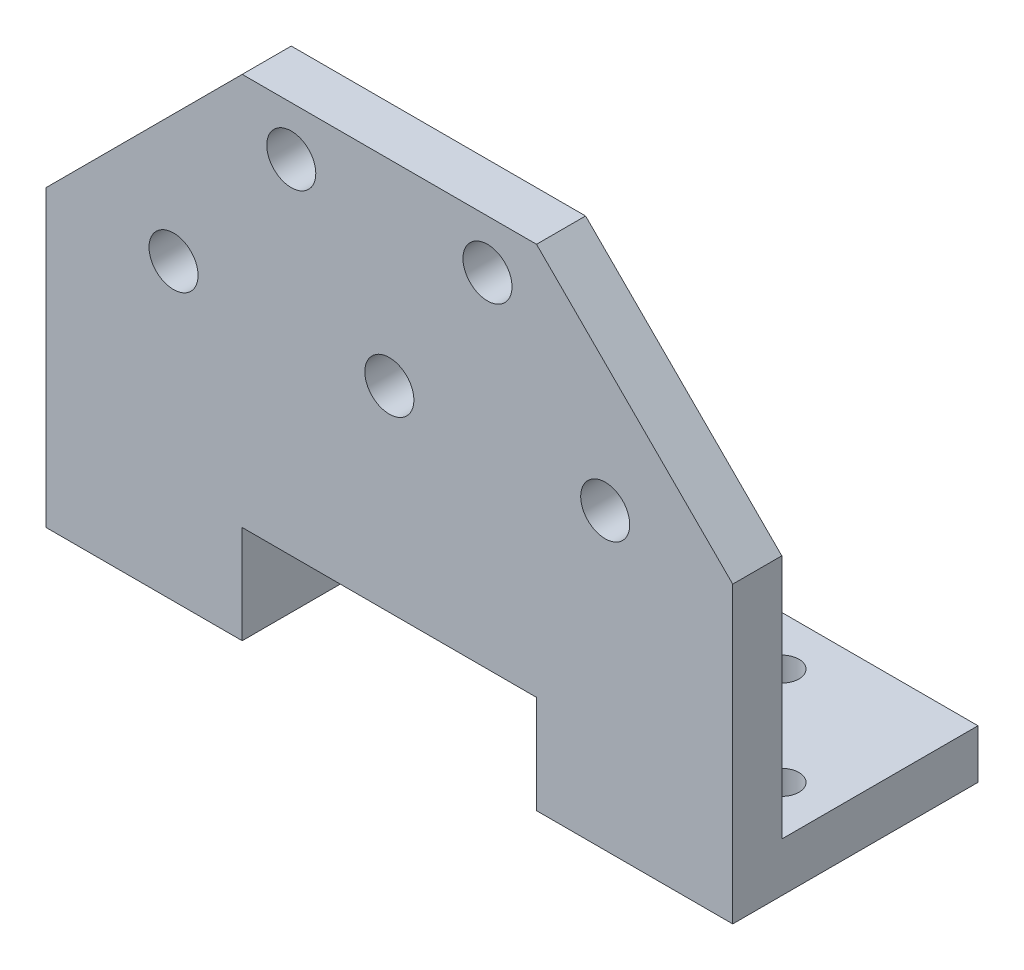
ISO-10303-21;
HEADER;
FILE_DESCRIPTION(('STEP AP214'),'2;1');
FILE_NAME('part.step','',(''),(''),'','','');
FILE_SCHEMA(('AUTOMOTIVE_DESIGN { 1 0 10303 214 1 1 1 1 }'));
ENDSEC;
DATA;
#1=APPLICATION_CONTEXT('core data for automotive mechanical design processes');
#2=APPLICATION_PROTOCOL_DEFINITION('international standard','automotive_design',2000,#1);
#3=PRODUCT_CONTEXT('',#1,'mechanical');
#4=PRODUCT('Part','Part','',(#3));
#5=PRODUCT_RELATED_PRODUCT_CATEGORY('part','',(#4));
#6=PRODUCT_DEFINITION_FORMATION('','',#4);
#7=PRODUCT_DEFINITION_CONTEXT('part definition',#1,'design');
#8=PRODUCT_DEFINITION('design','',#6,#7);
#9=PRODUCT_DEFINITION_SHAPE('','',#8);
#10=(LENGTH_UNIT() NAMED_UNIT(*) SI_UNIT(.MILLI.,.METRE.));
#11=(NAMED_UNIT(*) PLANE_ANGLE_UNIT() SI_UNIT($,.RADIAN.));
#12=(NAMED_UNIT(*) SI_UNIT($,.STERADIAN.) SOLID_ANGLE_UNIT());
#13=UNCERTAINTY_MEASURE_WITH_UNIT(LENGTH_MEASURE(1.E-05),#10,'distance_accuracy_value','');
#14=(GEOMETRIC_REPRESENTATION_CONTEXT(3) GLOBAL_UNCERTAINTY_ASSIGNED_CONTEXT((#13)) GLOBAL_UNIT_ASSIGNED_CONTEXT((#10,
#11,#12)) REPRESENTATION_CONTEXT('',''));
#15=CARTESIAN_POINT('',(0.,0.,0.));
#16=DIRECTION('',(0.,0.,1.));
#17=DIRECTION('',(1.,0.,0.));
#18=AXIS2_PLACEMENT_3D('',#15,#16,#17);
#19=CARTESIAN_POINT('',(0.,0.,0.));
#20=DIRECTION('',(0.,0.,1.));
#21=DIRECTION('',(1.,0.,0.));
#22=AXIS2_PLACEMENT_3D('',#19,#20,#21);
#23=PLANE('',#22);
#24=CARTESIAN_POINT('',(22.,30.,0.));
#25=DIRECTION('',(0.,0.,-1.));
#26=DIRECTION('',(-1.,0.,0.));
#27=AXIS2_PLACEMENT_3D('',#24,#25,#26);
#28=CIRCLE('',#27,2.5);
#29=CARTESIAN_POINT('',(19.5,30.,0.));
#30=VERTEX_POINT('',#29);
#31=EDGE_CURVE('E397',#30,#30,#28,.T.);
#32=ORIENTED_EDGE('',*,*,#31,.F.);
#33=EDGE_LOOP('',(#32));
#34=FACE_BOUND('',#33,.T.);
#35=CARTESIAN_POINT('',(0.,30.,0.));
#36=DIRECTION('',(0.,0.,-1.));
#37=DIRECTION('',(-1.,0.,0.));
#38=AXIS2_PLACEMENT_3D('',#35,#36,#37);
#39=CIRCLE('',#38,2.5);
#40=CARTESIAN_POINT('',(-2.5,30.,0.));
#41=VERTEX_POINT('',#40);
#42=EDGE_CURVE('E402',#41,#41,#39,.T.);
#43=ORIENTED_EDGE('',*,*,#42,.F.);
#44=EDGE_LOOP('',(#43));
#45=FACE_BOUND('',#44,.T.);
#46=CARTESIAN_POINT('',(10.,45.,0.));
#47=DIRECTION('',(0.,0.,-1.));
#48=DIRECTION('',(-1.,0.,0.));
#49=AXIS2_PLACEMENT_3D('',#46,#47,#48);
#50=CIRCLE('',#49,2.5);
#51=CARTESIAN_POINT('',(7.5,45.,0.));
#52=VERTEX_POINT('',#51);
#53=EDGE_CURVE('E410',#52,#52,#50,.T.);
#54=ORIENTED_EDGE('',*,*,#53,.F.);
#55=EDGE_LOOP('',(#54));
#56=FACE_BOUND('',#55,.T.);
#57=CARTESIAN_POINT('',(-10.,45.,0.));
#58=DIRECTION('',(0.,0.,-1.));
#59=DIRECTION('',(1.,0.,0.));
#60=AXIS2_PLACEMENT_3D('',#57,#58,#59);
#61=CIRCLE('',#60,2.5);
#62=CARTESIAN_POINT('',(-7.5,45.,0.));
#63=VERTEX_POINT('',#62);
#64=EDGE_CURVE('E416',#63,#63,#61,.T.);
#65=ORIENTED_EDGE('',*,*,#64,.F.);
#66=EDGE_LOOP('',(#65));
#67=FACE_BOUND('',#66,.T.);
#68=CARTESIAN_POINT('',(-22.,30.,0.));
#69=DIRECTION('',(0.,0.,-1.));
#70=DIRECTION('',(1.,0.,0.));
#71=AXIS2_PLACEMENT_3D('',#68,#69,#70);
#72=CIRCLE('',#71,2.5);
#73=CARTESIAN_POINT('',(-19.5,30.,0.));
#74=VERTEX_POINT('',#73);
#75=EDGE_CURVE('E421',#74,#74,#72,.T.);
#76=ORIENTED_EDGE('',*,*,#75,.F.);
#77=EDGE_LOOP('',(#76));
#78=FACE_BOUND('',#77,.T.);
#79=DIRECTION('',(-0.707106781186549,0.707106781186546,0.));
#80=VECTOR('',#79,1.);
#81=CARTESIAN_POINT('',(32.4999999999999,32.5000000000001,0.));
#82=LINE('',#81,#80);
#83=CARTESIAN_POINT('',(35.,30.,0.));
#84=VERTEX_POINT('',#83);
#85=CARTESIAN_POINT('',(14.9999999999999,50.,0.));
#86=VERTEX_POINT('',#85);
#87=EDGE_CURVE('E139',#84,#86,#82,.T.);
#88=ORIENTED_EDGE('',*,*,#87,.F.);
#89=DIRECTION('',(0.,1.,0.));
#90=VECTOR('',#89,1.);
#91=CARTESIAN_POINT('',(35.,0.,0.));
#92=LINE('',#91,#90);
#93=CARTESIAN_POINT('',(35.,5.,0.));
#94=VERTEX_POINT('',#93);
#95=EDGE_CURVE('E161',#94,#84,#92,.T.);
#96=ORIENTED_EDGE('',*,*,#95,.F.);
#97=DIRECTION('',(1.,0.,0.));
#98=VECTOR('',#97,1.);
#99=CARTESIAN_POINT('',(35.,5.,0.));
#100=LINE('',#99,#98);
#101=CARTESIAN_POINT('',(15.,5.,0.));
#102=VERTEX_POINT('',#101);
#103=EDGE_CURVE('E227',#102,#94,#100,.T.);
#104=ORIENTED_EDGE('',*,*,#103,.F.);
#105=DIRECTION('',(0.,-1.,0.));
#106=VECTOR('',#105,1.);
#107=CARTESIAN_POINT('',(15.,10.,0.));
#108=LINE('',#107,#106);
#109=CARTESIAN_POINT('',(15.,10.,0.));
#110=VERTEX_POINT('',#109);
#111=EDGE_CURVE('E254',#110,#102,#108,.T.);
#112=ORIENTED_EDGE('',*,*,#111,.F.);
#113=DIRECTION('',(1.,0.,0.));
#114=VECTOR('',#113,1.);
#115=CARTESIAN_POINT('',(-15.,10.,0.));
#116=LINE('',#115,#114);
#117=CARTESIAN_POINT('',(-15.,10.,0.));
#118=VERTEX_POINT('',#117);
#119=EDGE_CURVE('E159',#118,#110,#116,.T.);
#120=ORIENTED_EDGE('',*,*,#119,.F.);
#121=DIRECTION('',(0.,1.,0.));
#122=VECTOR('',#121,1.);
#123=CARTESIAN_POINT('',(-15.,10.,0.));
#124=LINE('',#123,#122);
#125=CARTESIAN_POINT('',(-15.,5.,0.));
#126=VERTEX_POINT('',#125);
#127=EDGE_CURVE('E156',#126,#118,#124,.T.);
#128=ORIENTED_EDGE('',*,*,#127,.F.);
#129=DIRECTION('',(1.,0.,0.));
#130=VECTOR('',#129,1.);
#131=CARTESIAN_POINT('',(-35.,5.,0.));
#132=LINE('',#131,#130);
#133=CARTESIAN_POINT('',(-35.,5.,0.));
#134=VERTEX_POINT('',#133);
#135=EDGE_CURVE('E154',#134,#126,#132,.T.);
#136=ORIENTED_EDGE('',*,*,#135,.F.);
#137=DIRECTION('',(0.,-1.,0.));
#138=VECTOR('',#137,1.);
#139=CARTESIAN_POINT('',(-35.,0.,0.));
#140=LINE('',#139,#138);
#141=CARTESIAN_POINT('',(-35.,30.,0.));
#142=VERTEX_POINT('',#141);
#143=EDGE_CURVE('E146',#142,#134,#140,.T.);
#144=ORIENTED_EDGE('',*,*,#143,.F.);
#145=DIRECTION('',(-0.707106781186549,-0.707106781186546,0.));
#146=VECTOR('',#145,1.);
#147=CARTESIAN_POINT('',(-32.4999999999999,32.5000000000001,0.));
#148=LINE('',#147,#146);
#149=CARTESIAN_POINT('',(-14.9999999999999,50.,0.));
#150=VERTEX_POINT('',#149);
#151=EDGE_CURVE('E131',#150,#142,#148,.T.);
#152=ORIENTED_EDGE('',*,*,#151,.F.);
#153=DIRECTION('',(-1.,0.,0.));
#154=VECTOR('',#153,1.);
#155=CARTESIAN_POINT('',(35.,50.,0.));
#156=LINE('',#155,#154);
#157=EDGE_CURVE('E157',#86,#150,#156,.T.);
#158=ORIENTED_EDGE('',*,*,#157,.F.);
#159=EDGE_LOOP('',(#88,#96,#104,#112,#120,#128,#136,#144,#152,#158));
#160=FACE_BOUND('',#159,.T.);
#161=ADVANCED_FACE('F33',(#34,#45,#56,#67,#78,#160),#23,.F.);
#162=CARTESIAN_POINT('',(35.,0.,5.));
#163=DIRECTION('',(-1.,0.,0.));
#164=DIRECTION('',(0.,0.,1.));
#165=AXIS2_PLACEMENT_3D('',#162,#163,#164);
#166=PLANE('',#165);
#167=DIRECTION('',(0.,0.,-1.));
#168=VECTOR('',#167,1.);
#169=CARTESIAN_POINT('',(35.,30.,123.227955419806));
#170=LINE('',#169,#168);
#171=CARTESIAN_POINT('',(35.,30.,5.));
#172=VERTEX_POINT('',#171);
#173=EDGE_CURVE('E140',#172,#84,#170,.T.);
#174=ORIENTED_EDGE('',*,*,#173,.F.);
#175=DIRECTION('',(0.,1.,0.));
#176=VECTOR('',#175,1.);
#177=CARTESIAN_POINT('',(35.,0.,5.));
#178=LINE('',#177,#176);
#179=CARTESIAN_POINT('',(35.,0.,5.));
#180=VERTEX_POINT('',#179);
#181=EDGE_CURVE('E259',#180,#172,#178,.T.);
#182=ORIENTED_EDGE('',*,*,#181,.F.);
#183=DIRECTION('',(0.,0.,-1.));
#184=VECTOR('',#183,1.);
#185=CARTESIAN_POINT('',(35.,0.,5.));
#186=LINE('',#185,#184);
#187=CARTESIAN_POINT('',(35.,0.,-20.));
#188=VERTEX_POINT('',#187);
#189=EDGE_CURVE('E178',#180,#188,#186,.T.);
#190=ORIENTED_EDGE('',*,*,#189,.T.);
#191=DIRECTION('',(0.,-1.,0.));
#192=VECTOR('',#191,1.);
#193=CARTESIAN_POINT('',(35.,5.,-20.));
#194=LINE('',#193,#192);
#195=CARTESIAN_POINT('',(35.,5.,-20.));
#196=VERTEX_POINT('',#195);
#197=EDGE_CURVE('E235',#196,#188,#194,.T.);
#198=ORIENTED_EDGE('',*,*,#197,.F.);
#199=DIRECTION('',(0.,0.,-1.));
#200=VECTOR('',#199,1.);
#201=CARTESIAN_POINT('',(35.,5.,0.));
#202=LINE('',#201,#200);
#203=EDGE_CURVE('E220',#94,#196,#202,.T.);
#204=ORIENTED_EDGE('',*,*,#203,.F.);
#205=ORIENTED_EDGE('',*,*,#95,.T.);
#206=EDGE_LOOP('',(#174,#182,#190,#198,#204,#205));
#207=FACE_BOUND('',#206,.T.);
#208=ADVANCED_FACE('F273',(#207),#166,.F.);
#209=CARTESIAN_POINT('',(35.,50.,5.));
#210=DIRECTION('',(0.,-1.,0.));
#211=DIRECTION('',(0.,0.,-1.));
#212=AXIS2_PLACEMENT_3D('',#209,#210,#211);
#213=PLANE('',#212);
#214=DIRECTION('',(-1.,0.,0.));
#215=VECTOR('',#214,1.);
#216=CARTESIAN_POINT('',(35.,50.,5.));
#217=LINE('',#216,#215);
#218=CARTESIAN_POINT('',(14.9999999999999,50.,5.));
#219=VERTEX_POINT('',#218);
#220=CARTESIAN_POINT('',(-14.9999999999999,50.,5.));
#221=VERTEX_POINT('',#220);
#222=EDGE_CURVE('E186',#219,#221,#217,.T.);
#223=ORIENTED_EDGE('',*,*,#222,.F.);
#224=DIRECTION('',(0.,0.,-1.));
#225=VECTOR('',#224,1.);
#226=CARTESIAN_POINT('',(14.9999999999999,50.,123.227955419806));
#227=LINE('',#226,#225);
#228=EDGE_CURVE('E56',#219,#86,#227,.T.);
#229=ORIENTED_EDGE('',*,*,#228,.T.);
#230=ORIENTED_EDGE('',*,*,#157,.T.);
#231=DIRECTION('',(0.,0.,-1.));
#232=VECTOR('',#231,1.);
#233=CARTESIAN_POINT('',(-14.9999999999999,50.,123.227955419806));
#234=LINE('',#233,#232);
#235=EDGE_CURVE('E134',#221,#150,#234,.T.);
#236=ORIENTED_EDGE('',*,*,#235,.F.);
#237=EDGE_LOOP('',(#223,#229,#230,#236));
#238=FACE_BOUND('',#237,.T.);
#239=ADVANCED_FACE('F188',(#238),#213,.F.);
#240=CARTESIAN_POINT('',(-35.,0.,5.));
#241=DIRECTION('',(1.,0.,0.));
#242=DIRECTION('',(0.,0.,-1.));
#243=AXIS2_PLACEMENT_3D('',#240,#241,#242);
#244=PLANE('',#243);
#245=DIRECTION('',(0.,0.,-1.));
#246=VECTOR('',#245,1.);
#247=CARTESIAN_POINT('',(-35.,30.,123.227955419806));
#248=LINE('',#247,#246);
#249=CARTESIAN_POINT('',(-35.,30.,5.));
#250=VERTEX_POINT('',#249);
#251=EDGE_CURVE('E48',#250,#142,#248,.T.);
#252=ORIENTED_EDGE('',*,*,#251,.T.);
#253=ORIENTED_EDGE('',*,*,#143,.T.);
#254=DIRECTION('',(0.,0.,1.));
#255=VECTOR('',#254,1.);
#256=CARTESIAN_POINT('',(-35.,5.,0.));
#257=LINE('',#256,#255);
#258=CARTESIAN_POINT('',(-35.,5.,-20.));
#259=VERTEX_POINT('',#258);
#260=EDGE_CURVE('E239',#259,#134,#257,.T.);
#261=ORIENTED_EDGE('',*,*,#260,.F.);
#262=DIRECTION('',(0.,-1.,0.));
#263=VECTOR('',#262,1.);
#264=CARTESIAN_POINT('',(-35.,5.,-20.));
#265=LINE('',#264,#263);
#266=CARTESIAN_POINT('',(-35.,0.,-20.));
#267=VERTEX_POINT('',#266);
#268=EDGE_CURVE('E246',#259,#267,#265,.T.);
#269=ORIENTED_EDGE('',*,*,#268,.T.);
#270=DIRECTION('',(0.,0.,-1.));
#271=VECTOR('',#270,1.);
#272=CARTESIAN_POINT('',(-35.,0.,5.));
#273=LINE('',#272,#271);
#274=CARTESIAN_POINT('',(-35.,0.,5.));
#275=VERTEX_POINT('',#274);
#276=EDGE_CURVE('E176',#275,#267,#273,.T.);
#277=ORIENTED_EDGE('',*,*,#276,.F.);
#278=DIRECTION('',(0.,-1.,0.));
#279=VECTOR('',#278,1.);
#280=CARTESIAN_POINT('',(-35.,0.,5.));
#281=LINE('',#280,#279);
#282=EDGE_CURVE('E149',#250,#275,#281,.T.);
#283=ORIENTED_EDGE('',*,*,#282,.F.);
#284=EDGE_LOOP('',(#252,#253,#261,#269,#277,#283));
#285=FACE_BOUND('',#284,.T.);
#286=ADVANCED_FACE('F144',(#285),#244,.F.);
#287=CARTESIAN_POINT('',(0.,0.,5.));
#288=DIRECTION('',(0.,0.,1.));
#289=DIRECTION('',(1.,0.,0.));
#290=AXIS2_PLACEMENT_3D('',#287,#288,#289);
#291=PLANE('',#290);
#292=CARTESIAN_POINT('',(22.,30.,5.));
#293=DIRECTION('',(0.,0.,-1.));
#294=DIRECTION('',(-1.,0.,0.));
#295=AXIS2_PLACEMENT_3D('',#292,#293,#294);
#296=CIRCLE('',#295,2.5);
#297=CARTESIAN_POINT('',(19.5,30.,5.));
#298=VERTEX_POINT('',#297);
#299=EDGE_CURVE('E150',#298,#298,#296,.T.);
#300=ORIENTED_EDGE('',*,*,#299,.T.);
#301=EDGE_LOOP('',(#300));
#302=FACE_BOUND('',#301,.T.);
#303=CARTESIAN_POINT('',(0.,30.,5.));
#304=DIRECTION('',(0.,0.,-1.));
#305=DIRECTION('',(-1.,0.,0.));
#306=AXIS2_PLACEMENT_3D('',#303,#304,#305);
#307=CIRCLE('',#306,2.5);
#308=CARTESIAN_POINT('',(-2.5,30.,5.));
#309=VERTEX_POINT('',#308);
#310=EDGE_CURVE('E398',#309,#309,#307,.T.);
#311=ORIENTED_EDGE('',*,*,#310,.T.);
#312=EDGE_LOOP('',(#311));
#313=FACE_BOUND('',#312,.T.);
#314=CARTESIAN_POINT('',(10.,45.,5.));
#315=DIRECTION('',(0.,0.,-1.));
#316=DIRECTION('',(-1.,0.,0.));
#317=AXIS2_PLACEMENT_3D('',#314,#315,#316);
#318=CIRCLE('',#317,2.5);
#319=CARTESIAN_POINT('',(7.5,45.,5.));
#320=VERTEX_POINT('',#319);
#321=EDGE_CURVE('E407',#320,#320,#318,.T.);
#322=ORIENTED_EDGE('',*,*,#321,.T.);
#323=EDGE_LOOP('',(#322));
#324=FACE_BOUND('',#323,.T.);
#325=CARTESIAN_POINT('',(-10.,45.,5.));
#326=DIRECTION('',(0.,0.,-1.));
#327=DIRECTION('',(1.,0.,0.));
#328=AXIS2_PLACEMENT_3D('',#325,#326,#327);
#329=CIRCLE('',#328,2.5);
#330=CARTESIAN_POINT('',(-7.5,45.,5.));
#331=VERTEX_POINT('',#330);
#332=EDGE_CURVE('E413',#331,#331,#329,.T.);
#333=ORIENTED_EDGE('',*,*,#332,.T.);
#334=EDGE_LOOP('',(#333));
#335=FACE_BOUND('',#334,.T.);
#336=CARTESIAN_POINT('',(-22.,30.,5.));
#337=DIRECTION('',(0.,0.,-1.));
#338=DIRECTION('',(1.,0.,0.));
#339=AXIS2_PLACEMENT_3D('',#336,#337,#338);
#340=CIRCLE('',#339,2.5);
#341=CARTESIAN_POINT('',(-19.5,30.,5.));
#342=VERTEX_POINT('',#341);
#343=EDGE_CURVE('E419',#342,#342,#340,.T.);
#344=ORIENTED_EDGE('',*,*,#343,.T.);
#345=EDGE_LOOP('',(#344));
#346=FACE_BOUND('',#345,.T.);
#347=ORIENTED_EDGE('',*,*,#181,.T.);
#348=DIRECTION('',(-0.707106781186549,0.707106781186546,0.));
#349=VECTOR('',#348,1.);
#350=CARTESIAN_POINT('',(32.4999999999999,32.5000000000001,5.));
#351=LINE('',#350,#349);
#352=EDGE_CURVE('E11',#172,#219,#351,.T.);
#353=ORIENTED_EDGE('',*,*,#352,.T.);
#354=ORIENTED_EDGE('',*,*,#222,.T.);
#355=DIRECTION('',(-0.707106781186549,-0.707106781186546,0.));
#356=VECTOR('',#355,1.);
#357=CARTESIAN_POINT('',(-32.4999999999999,32.5000000000001,5.));
#358=LINE('',#357,#356);
#359=EDGE_CURVE('E41',#221,#250,#358,.T.);
#360=ORIENTED_EDGE('',*,*,#359,.T.);
#361=ORIENTED_EDGE('',*,*,#282,.T.);
#362=DIRECTION('',(1.,0.,0.));
#363=VECTOR('',#362,1.);
#364=CARTESIAN_POINT('',(-15.,0.,5.));
#365=LINE('',#364,#363);
#366=CARTESIAN_POINT('',(-15.,0.,5.));
#367=VERTEX_POINT('',#366);
#368=EDGE_CURVE('E263',#275,#367,#365,.T.);
#369=ORIENTED_EDGE('',*,*,#368,.T.);
#370=DIRECTION('',(0.,1.,0.));
#371=VECTOR('',#370,1.);
#372=CARTESIAN_POINT('',(-15.,10.,5.));
#373=LINE('',#372,#371);
#374=CARTESIAN_POINT('',(-15.,10.,5.));
#375=VERTEX_POINT('',#374);
#376=EDGE_CURVE('E265',#367,#375,#373,.T.);
#377=ORIENTED_EDGE('',*,*,#376,.T.);
#378=DIRECTION('',(1.,0.,0.));
#379=VECTOR('',#378,1.);
#380=CARTESIAN_POINT('',(-15.,10.,5.));
#381=LINE('',#380,#379);
#382=CARTESIAN_POINT('',(15.,10.,5.));
#383=VERTEX_POINT('',#382);
#384=EDGE_CURVE('E171',#375,#383,#381,.T.);
#385=ORIENTED_EDGE('',*,*,#384,.T.);
#386=DIRECTION('',(0.,-1.,0.));
#387=VECTOR('',#386,1.);
#388=CARTESIAN_POINT('',(15.,10.,5.));
#389=LINE('',#388,#387);
#390=CARTESIAN_POINT('',(15.,0.,5.));
#391=VERTEX_POINT('',#390);
#392=EDGE_CURVE('E166',#383,#391,#389,.T.);
#393=ORIENTED_EDGE('',*,*,#392,.T.);
#394=DIRECTION('',(1.,0.,0.));
#395=VECTOR('',#394,1.);
#396=CARTESIAN_POINT('',(15.,0.,5.));
#397=LINE('',#396,#395);
#398=EDGE_CURVE('E257',#391,#180,#397,.T.);
#399=ORIENTED_EDGE('',*,*,#398,.T.);
#400=EDGE_LOOP('',(#347,#353,#354,#360,#361,#369,#377,#385,#393,#399));
#401=FACE_BOUND('',#400,.T.);
#402=ADVANCED_FACE('F184',(#302,#313,#324,#335,#346,#401),#291,.T.);
#403=CARTESIAN_POINT('',(15.,10.,5.));
#404=DIRECTION('',(1.,0.,0.));
#405=DIRECTION('',(0.,0.,-1.));
#406=AXIS2_PLACEMENT_3D('',#403,#404,#405);
#407=PLANE('',#406);
#408=ORIENTED_EDGE('',*,*,#111,.T.);
#409=DIRECTION('',(0.,0.,1.));
#410=VECTOR('',#409,1.);
#411=CARTESIAN_POINT('',(15.,5.,0.));
#412=LINE('',#411,#410);
#413=CARTESIAN_POINT('',(15.,5.,-20.));
#414=VERTEX_POINT('',#413);
#415=EDGE_CURVE('E225',#414,#102,#412,.T.);
#416=ORIENTED_EDGE('',*,*,#415,.F.);
#417=DIRECTION('',(0.,-1.,0.));
#418=VECTOR('',#417,1.);
#419=CARTESIAN_POINT('',(15.,5.,-20.));
#420=LINE('',#419,#418);
#421=CARTESIAN_POINT('',(15.,0.,-20.));
#422=VERTEX_POINT('',#421);
#423=EDGE_CURVE('E230',#414,#422,#420,.T.);
#424=ORIENTED_EDGE('',*,*,#423,.T.);
#425=DIRECTION('',(0.,0.,-1.));
#426=VECTOR('',#425,1.);
#427=CARTESIAN_POINT('',(15.,0.,5.));
#428=LINE('',#427,#426);
#429=EDGE_CURVE('E180',#391,#422,#428,.T.);
#430=ORIENTED_EDGE('',*,*,#429,.F.);
#431=ORIENTED_EDGE('',*,*,#392,.F.);
#432=DIRECTION('',(0.,0.,-1.));
#433=VECTOR('',#432,1.);
#434=CARTESIAN_POINT('',(15.,10.,5.));
#435=LINE('',#434,#433);
#436=EDGE_CURVE('E167',#383,#110,#435,.T.);
#437=ORIENTED_EDGE('',*,*,#436,.T.);
#438=EDGE_LOOP('',(#408,#416,#424,#430,#431,#437));
#439=FACE_BOUND('',#438,.T.);
#440=ADVANCED_FACE('F35',(#439),#407,.F.);
#441=CARTESIAN_POINT('',(15.,0.,5.));
#442=DIRECTION('',(0.,1.,0.));
#443=DIRECTION('',(0.,0.,1.));
#444=AXIS2_PLACEMENT_3D('',#441,#442,#443);
#445=PLANE('',#444);
#446=CARTESIAN_POINT('',(20.,0.,-15.));
#447=DIRECTION('',(0.,1.,0.));
#448=DIRECTION('',(0.,0.,-1.));
#449=AXIS2_PLACEMENT_3D('',#446,#447,#448);
#450=CIRCLE('',#449,1.75);
#451=CARTESIAN_POINT('',(20.,0.,-16.75));
#452=VERTEX_POINT('',#451);
#453=EDGE_CURVE('E209',#452,#452,#450,.T.);
#454=ORIENTED_EDGE('',*,*,#453,.T.);
#455=EDGE_LOOP('',(#454));
#456=FACE_BOUND('',#455,.T.);
#457=CARTESIAN_POINT('',(30.,0.,-5.));
#458=DIRECTION('',(0.,1.,0.));
#459=DIRECTION('',(0.,0.,-1.));
#460=AXIS2_PLACEMENT_3D('',#457,#458,#459);
#461=CIRCLE('',#460,1.75);
#462=CARTESIAN_POINT('',(30.,0.,-6.75));
#463=VERTEX_POINT('',#462);
#464=EDGE_CURVE('E215',#463,#463,#461,.T.);
#465=ORIENTED_EDGE('',*,*,#464,.T.);
#466=EDGE_LOOP('',(#465));
#467=FACE_BOUND('',#466,.T.);
#468=ORIENTED_EDGE('',*,*,#429,.T.);
#469=DIRECTION('',(-1.,0.,0.));
#470=VECTOR('',#469,1.);
#471=CARTESIAN_POINT('',(35.,0.,-20.));
#472=LINE('',#471,#470);
#473=EDGE_CURVE('E199',#188,#422,#472,.T.);
#474=ORIENTED_EDGE('',*,*,#473,.F.);
#475=ORIENTED_EDGE('',*,*,#189,.F.);
#476=ORIENTED_EDGE('',*,*,#398,.F.);
#477=EDGE_LOOP('',(#468,#474,#475,#476));
#478=FACE_BOUND('',#477,.T.);
#479=ADVANCED_FACE('F282',(#456,#467,#478),#445,.F.);
#480=CARTESIAN_POINT('',(-15.,0.,5.));
#481=DIRECTION('',(0.,1.,0.));
#482=DIRECTION('',(0.,0.,1.));
#483=AXIS2_PLACEMENT_3D('',#480,#481,#482);
#484=PLANE('',#483);
#485=CARTESIAN_POINT('',(-30.,0.,-5.));
#486=DIRECTION('',(0.,1.,0.));
#487=DIRECTION('',(0.,0.,1.));
#488=AXIS2_PLACEMENT_3D('',#485,#486,#487);
#489=CIRCLE('',#488,1.75);
#490=CARTESIAN_POINT('',(-30.,0.,-3.25));
#491=VERTEX_POINT('',#490);
#492=EDGE_CURVE('E196',#491,#491,#489,.T.);
#493=ORIENTED_EDGE('',*,*,#492,.T.);
#494=EDGE_LOOP('',(#493));
#495=FACE_BOUND('',#494,.T.);
#496=CARTESIAN_POINT('',(-20.,0.,-15.));
#497=DIRECTION('',(0.,1.,0.));
#498=DIRECTION('',(0.,0.,1.));
#499=AXIS2_PLACEMENT_3D('',#496,#497,#498);
#500=CIRCLE('',#499,1.75);
#501=CARTESIAN_POINT('',(-20.,0.,-13.25));
#502=VERTEX_POINT('',#501);
#503=EDGE_CURVE('E203',#502,#502,#500,.T.);
#504=ORIENTED_EDGE('',*,*,#503,.T.);
#505=EDGE_LOOP('',(#504));
#506=FACE_BOUND('',#505,.T.);
#507=ORIENTED_EDGE('',*,*,#276,.T.);
#508=DIRECTION('',(-1.,0.,0.));
#509=VECTOR('',#508,1.);
#510=CARTESIAN_POINT('',(-35.,0.,-20.));
#511=LINE('',#510,#509);
#512=CARTESIAN_POINT('',(-15.,0.,-20.));
#513=VERTEX_POINT('',#512);
#514=EDGE_CURVE('E238',#513,#267,#511,.T.);
#515=ORIENTED_EDGE('',*,*,#514,.F.);
#516=DIRECTION('',(0.,0.,-1.));
#517=VECTOR('',#516,1.);
#518=CARTESIAN_POINT('',(-15.,0.,5.));
#519=LINE('',#518,#517);
#520=EDGE_CURVE('E174',#367,#513,#519,.T.);
#521=ORIENTED_EDGE('',*,*,#520,.F.);
#522=ORIENTED_EDGE('',*,*,#368,.F.);
#523=EDGE_LOOP('',(#507,#515,#521,#522));
#524=FACE_BOUND('',#523,.T.);
#525=ADVANCED_FACE('F313',(#495,#506,#524),#484,.F.);
#526=CARTESIAN_POINT('',(-15.,10.,5.));
#527=DIRECTION('',(-1.,0.,0.));
#528=DIRECTION('',(0.,0.,1.));
#529=AXIS2_PLACEMENT_3D('',#526,#527,#528);
#530=PLANE('',#529);
#531=ORIENTED_EDGE('',*,*,#520,.T.);
#532=DIRECTION('',(0.,-1.,0.));
#533=VECTOR('',#532,1.);
#534=CARTESIAN_POINT('',(-15.,5.,-20.));
#535=LINE('',#534,#533);
#536=CARTESIAN_POINT('',(-15.,5.,-20.));
#537=VERTEX_POINT('',#536);
#538=EDGE_CURVE('E251',#537,#513,#535,.T.);
#539=ORIENTED_EDGE('',*,*,#538,.F.);
#540=DIRECTION('',(0.,0.,-1.));
#541=VECTOR('',#540,1.);
#542=CARTESIAN_POINT('',(-15.,5.,0.));
#543=LINE('',#542,#541);
#544=EDGE_CURVE('E242',#126,#537,#543,.T.);
#545=ORIENTED_EDGE('',*,*,#544,.F.);
#546=ORIENTED_EDGE('',*,*,#127,.T.);
#547=DIRECTION('',(0.,0.,-1.));
#548=VECTOR('',#547,1.);
#549=CARTESIAN_POINT('',(-15.,10.,5.));
#550=LINE('',#549,#548);
#551=EDGE_CURVE('E170',#375,#118,#550,.T.);
#552=ORIENTED_EDGE('',*,*,#551,.F.);
#553=ORIENTED_EDGE('',*,*,#376,.F.);
#554=EDGE_LOOP('',(#531,#539,#545,#546,#552,#553));
#555=FACE_BOUND('',#554,.T.);
#556=ADVANCED_FACE('F300',(#555),#530,.F.);
#557=CARTESIAN_POINT('',(-15.,10.,5.));
#558=DIRECTION('',(0.,1.,0.));
#559=DIRECTION('',(0.,0.,1.));
#560=AXIS2_PLACEMENT_3D('',#557,#558,#559);
#561=PLANE('',#560);
#562=ORIENTED_EDGE('',*,*,#119,.T.);
#563=ORIENTED_EDGE('',*,*,#436,.F.);
#564=ORIENTED_EDGE('',*,*,#384,.F.);
#565=ORIENTED_EDGE('',*,*,#551,.T.);
#566=EDGE_LOOP('',(#562,#563,#564,#565));
#567=FACE_BOUND('',#566,.T.);
#568=ADVANCED_FACE('F295',(#567),#561,.F.);
#569=CARTESIAN_POINT('',(-35.,5.,-20.));
#570=DIRECTION('',(0.,0.,1.));
#571=DIRECTION('',(1.,0.,0.));
#572=AXIS2_PLACEMENT_3D('',#569,#570,#571);
#573=PLANE('',#572);
#574=ORIENTED_EDGE('',*,*,#514,.T.);
#575=ORIENTED_EDGE('',*,*,#268,.F.);
#576=DIRECTION('',(-1.,0.,0.));
#577=VECTOR('',#576,1.);
#578=CARTESIAN_POINT('',(-35.,5.,-20.));
#579=LINE('',#578,#577);
#580=EDGE_CURVE('E244',#537,#259,#579,.T.);
#581=ORIENTED_EDGE('',*,*,#580,.F.);
#582=ORIENTED_EDGE('',*,*,#538,.T.);
#583=EDGE_LOOP('',(#574,#575,#581,#582));
#584=FACE_BOUND('',#583,.T.);
#585=ADVANCED_FACE('F309',(#584),#573,.F.);
#586=CARTESIAN_POINT('',(0.,5.,0.));
#587=DIRECTION('',(0.,-1.,0.));
#588=DIRECTION('',(0.,0.,-1.));
#589=AXIS2_PLACEMENT_3D('',#586,#587,#588);
#590=PLANE('',#589);
#591=CARTESIAN_POINT('',(-30.,5.,-5.));
#592=DIRECTION('',(0.,1.,0.));
#593=DIRECTION('',(0.,0.,1.));
#594=AXIS2_PLACEMENT_3D('',#591,#592,#593);
#595=CIRCLE('',#594,1.75);
#596=CARTESIAN_POINT('',(-30.,5.,-3.25));
#597=VERTEX_POINT('',#596);
#598=EDGE_CURVE('E200',#597,#597,#595,.T.);
#599=ORIENTED_EDGE('',*,*,#598,.F.);
#600=EDGE_LOOP('',(#599));
#601=FACE_BOUND('',#600,.T.);
#602=CARTESIAN_POINT('',(-20.,5.,-15.));
#603=DIRECTION('',(0.,1.,0.));
#604=DIRECTION('',(0.,0.,1.));
#605=AXIS2_PLACEMENT_3D('',#602,#603,#604);
#606=CIRCLE('',#605,1.75);
#607=CARTESIAN_POINT('',(-20.,5.,-13.25));
#608=VERTEX_POINT('',#607);
#609=EDGE_CURVE('E206',#608,#608,#606,.T.);
#610=ORIENTED_EDGE('',*,*,#609,.F.);
#611=EDGE_LOOP('',(#610));
#612=FACE_BOUND('',#611,.T.);
#613=ORIENTED_EDGE('',*,*,#260,.T.);
#614=ORIENTED_EDGE('',*,*,#135,.T.);
#615=ORIENTED_EDGE('',*,*,#544,.T.);
#616=ORIENTED_EDGE('',*,*,#580,.T.);
#617=EDGE_LOOP('',(#613,#614,#615,#616));
#618=FACE_BOUND('',#617,.T.);
#619=ADVANCED_FACE('F305',(#601,#612,#618),#590,.F.);
#620=CARTESIAN_POINT('',(35.,5.,-20.));
#621=DIRECTION('',(0.,0.,1.));
#622=DIRECTION('',(1.,0.,0.));
#623=AXIS2_PLACEMENT_3D('',#620,#621,#622);
#624=PLANE('',#623);
#625=ORIENTED_EDGE('',*,*,#473,.T.);
#626=ORIENTED_EDGE('',*,*,#423,.F.);
#627=DIRECTION('',(-1.,0.,0.));
#628=VECTOR('',#627,1.);
#629=CARTESIAN_POINT('',(35.,5.,-20.));
#630=LINE('',#629,#628);
#631=EDGE_CURVE('E223',#196,#414,#630,.T.);
#632=ORIENTED_EDGE('',*,*,#631,.F.);
#633=ORIENTED_EDGE('',*,*,#197,.T.);
#634=EDGE_LOOP('',(#625,#626,#632,#633));
#635=FACE_BOUND('',#634,.T.);
#636=ADVANCED_FACE('F286',(#635),#624,.F.);
#637=CARTESIAN_POINT('',(0.,5.,0.));
#638=DIRECTION('',(0.,1.,0.));
#639=DIRECTION('',(0.,0.,1.));
#640=AXIS2_PLACEMENT_3D('',#637,#638,#639);
#641=PLANE('',#640);
#642=CARTESIAN_POINT('',(20.,5.,-15.));
#643=DIRECTION('',(0.,1.,0.));
#644=DIRECTION('',(0.,0.,-1.));
#645=AXIS2_PLACEMENT_3D('',#642,#643,#644);
#646=CIRCLE('',#645,1.75);
#647=CARTESIAN_POINT('',(20.,5.,-16.75));
#648=VERTEX_POINT('',#647);
#649=EDGE_CURVE('E212',#648,#648,#646,.T.);
#650=ORIENTED_EDGE('',*,*,#649,.F.);
#651=EDGE_LOOP('',(#650));
#652=FACE_BOUND('',#651,.T.);
#653=CARTESIAN_POINT('',(30.,5.,-5.));
#654=DIRECTION('',(0.,1.,0.));
#655=DIRECTION('',(0.,0.,-1.));
#656=AXIS2_PLACEMENT_3D('',#653,#654,#655);
#657=CIRCLE('',#656,1.75);
#658=CARTESIAN_POINT('',(30.,5.,-6.75));
#659=VERTEX_POINT('',#658);
#660=EDGE_CURVE('E195',#659,#659,#657,.T.);
#661=ORIENTED_EDGE('',*,*,#660,.F.);
#662=EDGE_LOOP('',(#661));
#663=FACE_BOUND('',#662,.T.);
#664=ORIENTED_EDGE('',*,*,#203,.T.);
#665=ORIENTED_EDGE('',*,*,#631,.T.);
#666=ORIENTED_EDGE('',*,*,#415,.T.);
#667=ORIENTED_EDGE('',*,*,#103,.T.);
#668=EDGE_LOOP('',(#664,#665,#666,#667));
#669=FACE_BOUND('',#668,.T.);
#670=ADVANCED_FACE('F289',(#652,#663,#669),#641,.T.);
#671=CARTESIAN_POINT('',(30.,0.,-5.));
#672=DIRECTION('',(0.,1.,0.));
#673=DIRECTION('',(0.,0.,1.));
#674=AXIS2_PLACEMENT_3D('',#671,#672,#673);
#675=CYLINDRICAL_SURFACE('',#674,1.75);
#676=ORIENTED_EDGE('',*,*,#464,.F.);
#677=EDGE_LOOP('',(#676));
#678=FACE_BOUND('',#677,.T.);
#679=ORIENTED_EDGE('',*,*,#660,.T.);
#680=EDGE_LOOP('',(#679));
#681=FACE_BOUND('',#680,.T.);
#682=ADVANCED_FACE('F351',(#678,#681),#675,.F.);
#683=CARTESIAN_POINT('',(20.,0.,-15.));
#684=DIRECTION('',(0.,1.,0.));
#685=DIRECTION('',(0.,0.,1.));
#686=AXIS2_PLACEMENT_3D('',#683,#684,#685);
#687=CYLINDRICAL_SURFACE('',#686,1.75);
#688=ORIENTED_EDGE('',*,*,#453,.F.);
#689=EDGE_LOOP('',(#688));
#690=FACE_BOUND('',#689,.T.);
#691=ORIENTED_EDGE('',*,*,#649,.T.);
#692=EDGE_LOOP('',(#691));
#693=FACE_BOUND('',#692,.T.);
#694=ADVANCED_FACE('F355',(#690,#693),#687,.F.);
#695=CARTESIAN_POINT('',(-20.,0.,-15.));
#696=DIRECTION('',(0.,1.,0.));
#697=DIRECTION('',(0.,0.,1.));
#698=AXIS2_PLACEMENT_3D('',#695,#696,#697);
#699=CYLINDRICAL_SURFACE('',#698,1.75);
#700=ORIENTED_EDGE('',*,*,#503,.F.);
#701=EDGE_LOOP('',(#700));
#702=FACE_BOUND('',#701,.T.);
#703=ORIENTED_EDGE('',*,*,#609,.T.);
#704=EDGE_LOOP('',(#703));
#705=FACE_BOUND('',#704,.T.);
#706=ADVANCED_FACE('F359',(#702,#705),#699,.F.);
#707=CARTESIAN_POINT('',(-30.,0.,-5.));
#708=DIRECTION('',(0.,1.,0.));
#709=DIRECTION('',(0.,0.,1.));
#710=AXIS2_PLACEMENT_3D('',#707,#708,#709);
#711=CYLINDRICAL_SURFACE('',#710,1.75);
#712=ORIENTED_EDGE('',*,*,#492,.F.);
#713=EDGE_LOOP('',(#712));
#714=FACE_BOUND('',#713,.T.);
#715=ORIENTED_EDGE('',*,*,#598,.T.);
#716=EDGE_LOOP('',(#715));
#717=FACE_BOUND('',#716,.T.);
#718=ADVANCED_FACE('F363',(#714,#717),#711,.F.);
#719=CARTESIAN_POINT('',(-35.,30.,123.227955419806));
#720=DIRECTION('',(-0.707106781186546,0.707106781186549,0.));
#721=DIRECTION('',(-0.707106781186549,-0.707106781186546,0.));
#722=AXIS2_PLACEMENT_3D('',#719,#720,#721);
#723=PLANE('',#722);
#724=ORIENTED_EDGE('',*,*,#235,.T.);
#725=ORIENTED_EDGE('',*,*,#151,.T.);
#726=ORIENTED_EDGE('',*,*,#251,.F.);
#727=ORIENTED_EDGE('',*,*,#359,.F.);
#728=EDGE_LOOP('',(#724,#725,#726,#727));
#729=FACE_BOUND('',#728,.T.);
#730=ADVANCED_FACE('F132',(#729),#723,.T.);
#731=CARTESIAN_POINT('',(35.,30.,123.227955419806));
#732=DIRECTION('',(0.707106781186546,0.707106781186549,0.));
#733=DIRECTION('',(-0.707106781186549,0.707106781186546,0.));
#734=AXIS2_PLACEMENT_3D('',#731,#732,#733);
#735=PLANE('',#734);
#736=ORIENTED_EDGE('',*,*,#173,.T.);
#737=ORIENTED_EDGE('',*,*,#87,.T.);
#738=ORIENTED_EDGE('',*,*,#228,.F.);
#739=ORIENTED_EDGE('',*,*,#352,.F.);
#740=EDGE_LOOP('',(#736,#737,#738,#739));
#741=FACE_BOUND('',#740,.T.);
#742=ADVANCED_FACE('F278',(#741),#735,.T.);
#743=CARTESIAN_POINT('',(-22.,30.,5.));
#744=DIRECTION('',(0.,0.,-1.));
#745=DIRECTION('',(-1.,0.,0.));
#746=AXIS2_PLACEMENT_3D('',#743,#744,#745);
#747=CYLINDRICAL_SURFACE('',#746,2.5);
#748=ORIENTED_EDGE('',*,*,#343,.F.);
#749=EDGE_LOOP('',(#748));
#750=FACE_BOUND('',#749,.T.);
#751=ORIENTED_EDGE('',*,*,#75,.T.);
#752=EDGE_LOOP('',(#751));
#753=FACE_BOUND('',#752,.T.);
#754=ADVANCED_FACE('F370',(#750,#753),#747,.F.);
#755=CARTESIAN_POINT('',(-10.,45.,5.));
#756=DIRECTION('',(0.,0.,-1.));
#757=DIRECTION('',(-1.,0.,0.));
#758=AXIS2_PLACEMENT_3D('',#755,#756,#757);
#759=CYLINDRICAL_SURFACE('',#758,2.5);
#760=ORIENTED_EDGE('',*,*,#332,.F.);
#761=EDGE_LOOP('',(#760));
#762=FACE_BOUND('',#761,.T.);
#763=ORIENTED_EDGE('',*,*,#64,.T.);
#764=EDGE_LOOP('',(#763));
#765=FACE_BOUND('',#764,.T.);
#766=ADVANCED_FACE('F375',(#762,#765),#759,.F.);
#767=CARTESIAN_POINT('',(10.,45.,5.));
#768=DIRECTION('',(0.,0.,-1.));
#769=DIRECTION('',(-1.,0.,0.));
#770=AXIS2_PLACEMENT_3D('',#767,#768,#769);
#771=CYLINDRICAL_SURFACE('',#770,2.5);
#772=ORIENTED_EDGE('',*,*,#321,.F.);
#773=EDGE_LOOP('',(#772));
#774=FACE_BOUND('',#773,.T.);
#775=ORIENTED_EDGE('',*,*,#53,.T.);
#776=EDGE_LOOP('',(#775));
#777=FACE_BOUND('',#776,.T.);
#778=ADVANCED_FACE('F379',(#774,#777),#771,.F.);
#779=CARTESIAN_POINT('',(0.,30.,5.));
#780=DIRECTION('',(0.,0.,-1.));
#781=DIRECTION('',(-1.,0.,0.));
#782=AXIS2_PLACEMENT_3D('',#779,#780,#781);
#783=CYLINDRICAL_SURFACE('',#782,2.5);
#784=ORIENTED_EDGE('',*,*,#310,.F.);
#785=EDGE_LOOP('',(#784));
#786=FACE_BOUND('',#785,.T.);
#787=ORIENTED_EDGE('',*,*,#42,.T.);
#788=EDGE_LOOP('',(#787));
#789=FACE_BOUND('',#788,.T.);
#790=ADVANCED_FACE('F383',(#786,#789),#783,.F.);
#791=CARTESIAN_POINT('',(22.,30.,5.));
#792=DIRECTION('',(0.,0.,-1.));
#793=DIRECTION('',(-1.,0.,0.));
#794=AXIS2_PLACEMENT_3D('',#791,#792,#793);
#795=CYLINDRICAL_SURFACE('',#794,2.5);
#796=ORIENTED_EDGE('',*,*,#299,.F.);
#797=EDGE_LOOP('',(#796));
#798=FACE_BOUND('',#797,.T.);
#799=ORIENTED_EDGE('',*,*,#31,.T.);
#800=EDGE_LOOP('',(#799));
#801=FACE_BOUND('',#800,.T.);
#802=ADVANCED_FACE('F387',(#798,#801),#795,.F.);
#803=CLOSED_SHELL('',(#161,#208,#239,#286,#402,#440,#479,#525,#556,#568,#585,#619,#636,#670,
#682,#694,#706,#718,#730,#742,#754,#766,#778,#790,#802));
#804=MANIFOLD_SOLID_BREP('B2',#803);
#805=ADVANCED_BREP_SHAPE_REPRESENTATION('',(#18,#804),#14);
#806=SHAPE_DEFINITION_REPRESENTATION(#9,#805);
ENDSEC;
END-ISO-10303-21;
